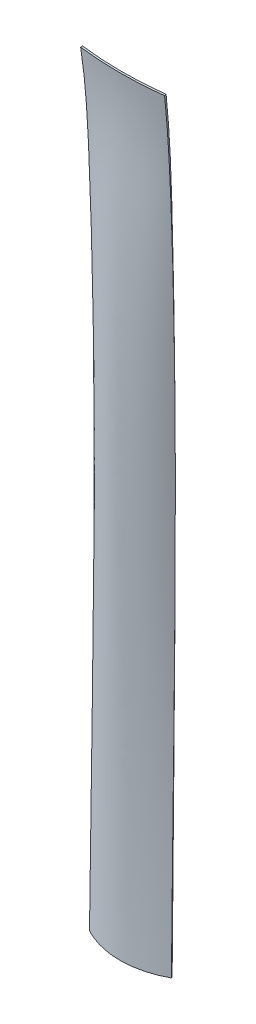
ISO-10303-21;
HEADER;
FILE_DESCRIPTION(('STEP AP214'),'2;1');
FILE_NAME('part.step','',(''),(''),'','','');
FILE_SCHEMA(('AUTOMOTIVE_DESIGN { 1 0 10303 214 1 1 1 1 }'));
ENDSEC;
DATA;
#1=APPLICATION_CONTEXT('core data for automotive mechanical design processes');
#2=APPLICATION_PROTOCOL_DEFINITION('international standard','automotive_design',2000,#1);
#3=PRODUCT_CONTEXT('',#1,'mechanical');
#4=PRODUCT('Part','Part','',(#3));
#5=PRODUCT_RELATED_PRODUCT_CATEGORY('part','',(#4));
#6=PRODUCT_DEFINITION_FORMATION('','',#4);
#7=PRODUCT_DEFINITION_CONTEXT('part definition',#1,'design');
#8=PRODUCT_DEFINITION('design','',#6,#7);
#9=PRODUCT_DEFINITION_SHAPE('','',#8);
#10=(LENGTH_UNIT() NAMED_UNIT(*) SI_UNIT(.MILLI.,.METRE.));
#11=(NAMED_UNIT(*) PLANE_ANGLE_UNIT() SI_UNIT($,.RADIAN.));
#12=(NAMED_UNIT(*) SI_UNIT($,.STERADIAN.) SOLID_ANGLE_UNIT());
#13=UNCERTAINTY_MEASURE_WITH_UNIT(LENGTH_MEASURE(1.E-05),#10,'distance_accuracy_value','');
#14=(GEOMETRIC_REPRESENTATION_CONTEXT(3) GLOBAL_UNCERTAINTY_ASSIGNED_CONTEXT((#13)) GLOBAL_UNIT_ASSIGNED_CONTEXT((#10,
#11,#12)) REPRESENTATION_CONTEXT('',''));
#15=CARTESIAN_POINT('',(0.,0.,0.));
#16=DIRECTION('',(0.,0.,1.));
#17=DIRECTION('',(1.,0.,0.));
#18=AXIS2_PLACEMENT_3D('',#15,#16,#17);
#19=CARTESIAN_POINT('',(9.50062272301137,175.,18.4603676133465));
#20=CARTESIAN_POINT('',(3.19127951394661,175.,19.2465429783567));
#21=CARTESIAN_POINT('',(-3.19127951394665,175.,19.2465429783567));
#22=CARTESIAN_POINT('',(-9.50062272301141,175.,18.4603676133465));
#23=CARTESIAN_POINT('',(9.54965754031191,174.947694814354,18.8538898544547));
#24=CARTESIAN_POINT('',(3.20777013235998,174.948930577557,19.6442846396067));
#25=CARTESIAN_POINT('',(-3.20777013236002,174.948930577557,19.6442846396067));
#26=CARTESIAN_POINT('',(-9.54965754031195,174.947694814354,18.8538898544547));
#27=B_SPLINE_SURFACE_WITH_KNOTS('',1,3,((#19,#20,#21,#22),(#23,#24,#25,#26)),.UNSPECIFIED.,.F.,
.F.,.F.,(2,2),(4,4),(0.,1.),(0.,1.),.UNSPECIFIED.);
#28=CARTESIAN_POINT('',(-9.54965754031195,174.947694814354,18.8538898544547));
#29=CARTESIAN_POINT('',(-9.50062272301141,175.,18.4603676133465));
#30=B_SPLINE_CURVE_WITH_KNOTS('',1,(#28,#29),.UNSPECIFIED.,.F.,.F.,(2,2),(0.,1.),.UNSPECIFIED.);
#31=CARTESIAN_POINT('',(-9.54965753794148,174.947694727238,18.8538898431711));
#32=VERTEX_POINT('',#31);
#33=CARTESIAN_POINT('',(-9.50062272301141,175.,18.4603676133465));
#34=VERTEX_POINT('',#33);
#35=EDGE_CURVE('E11',#32,#34,#30,.T.);
#36=CARTESIAN_POINT('',(-9.54965754031195,174.947694814354,18.8538898544547));
#37=CARTESIAN_POINT('',(-3.20777013236002,174.948930577557,19.6442846396067));
#38=CARTESIAN_POINT('',(3.20777013235998,174.948930577557,19.6442846396067));
#39=CARTESIAN_POINT('',(9.54965754031191,174.947694814354,18.8538898544547));
#40=B_SPLINE_CURVE_WITH_KNOTS('',3,(#36,#37,#38,#39),.UNSPECIFIED.,.F.,.F.,(4,4),(0.,1.),.UNSPECIFIED.);
#41=CARTESIAN_POINT('',(9.54965753079908,174.947694814356,18.8538898556403));
#42=VERTEX_POINT('',#41);
#43=EDGE_CURVE('E101',#32,#42,#40,.T.);
#44=CARTESIAN_POINT('',(9.54965754031191,174.947694814354,18.8538898544547));
#45=CARTESIAN_POINT('',(9.50062272301137,175.,18.4603676133465));
#46=B_SPLINE_CURVE_WITH_KNOTS('',1,(#44,#45),.UNSPECIFIED.,.F.,.F.,(2,2),(0.,1.),.UNSPECIFIED.);
#47=CARTESIAN_POINT('',(9.50062272301137,175.,18.4603676133465));
#48=VERTEX_POINT('',#47);
#49=EDGE_CURVE('E49',#42,#48,#46,.T.);
#50=CARTESIAN_POINT('',(-9.50062272301141,175.,18.4603676133465));
#51=CARTESIAN_POINT('',(-3.19127951394665,175.,19.2465429783567));
#52=CARTESIAN_POINT('',(3.19127951394661,175.,19.2465429783567));
#53=CARTESIAN_POINT('',(9.50062272301137,175.,18.4603676133465));
#54=B_SPLINE_CURVE_WITH_KNOTS('',3,(#50,#51,#52,#53),.UNSPECIFIED.,.F.,.F.,(4,4),(0.,1.),.UNSPECIFIED.);
#55=EDGE_CURVE('E236',#34,#48,#54,.T.);
#56=ORIENTED_EDGE('',*,*,#35,.F.);
#57=ORIENTED_EDGE('',*,*,#43,.T.);
#58=ORIENTED_EDGE('',*,*,#49,.T.);
#59=ORIENTED_EDGE('',*,*,#55,.F.);
#60=EDGE_LOOP('',(#56,#57,#58,#59));
#61=FACE_BOUND('',#60,.T.);
#62=ADVANCED_FACE('F35',(#61),#27,.F.);
#63=CARTESIAN_POINT('',(9.13305651041006,0.,16.7179478040116));
#64=CARTESIAN_POINT('',(9.10242362118428,14.5874827791793,16.5727349112747));
#65=CARTESIAN_POINT('',(9.05842448259301,29.17759846797,16.3641603251273));
#66=CARTESIAN_POINT('',(8.98273007342552,58.3577161391967,16.0053367078641));
#67=CARTESIAN_POINT('',(8.9510348028493,72.9477181216326,15.8550876767483));
#68=CARTESIAN_POINT('',(8.94199707305575,94.8286011713372,15.812245002738));
#69=CARTESIAN_POINT('',(8.94540202580303,102.12154220058,15.8283859235118));
#70=CARTESIAN_POINT('',(8.9699265358311,116.705378510387,15.944642507012));
#71=CARTESIAN_POINT('',(8.9910460931119,123.99627379095,16.0447581697385));
#72=CARTESIAN_POINT('',(9.03967104181566,134.930578069761,16.2752610585914));
#73=CARTESIAN_POINT('',(9.05870362684734,138.575006389026,16.3654835873362));
#74=CARTESIAN_POINT('',(9.09194636501331,144.0410761661,16.5230682714316));
#75=CARTESIAN_POINT('',(9.10380958783838,145.86300397482,16.5793049812931));
#76=CARTESIAN_POINT('',(9.12917689659846,149.506658184768,16.69955678839));
#77=CARTESIAN_POINT('',(9.14249365435798,151.328390500802,16.7626838705886));
#78=CARTESIAN_POINT('',(9.18690823182216,156.793209944169,16.973227813268));
#79=CARTESIAN_POINT('',(9.22302104918561,160.435902178857,17.1444178905596));
#80=CARTESIAN_POINT('',(9.33016005976901,167.719488686941,17.6523022607575));
#81=CARTESIAN_POINT('',(9.40118625298895,171.360382960338,17.9889965536639));
#82=CARTESIAN_POINT('',(9.50062272301137,175.,18.4603676133465));
#83=CARTESIAN_POINT('',(9.32481762493465,0.00389692311497571,17.0689641696508));
#84=CARTESIAN_POINT('',(9.29470936483299,14.5925291041365,16.9234519102562));
#85=CARTESIAN_POINT('',(9.27813646614287,29.1827862734098,16.6997657405732));
#86=CARTESIAN_POINT('',(9.25081294940914,58.36159007335,16.3037455350724));
#87=CARTESIAN_POINT('',(9.23915794321485,72.9502275496611,16.1327494244119));
#88=CARTESIAN_POINT('',(9.2409175524814,94.8283217894422,16.0780941907476));
#89=CARTESIAN_POINT('',(9.24510505604379,102.120198079987,16.0933487573779));
#90=CARTESIAN_POINT('',(9.26258927139339,116.701440507119,16.2173365327432));
#91=CARTESIAN_POINT('',(9.27625601396391,123.990805962327,16.3261341762202));
#92=CARTESIAN_POINT('',(9.2988871381627,134.922134935665,16.5800109431897));
#93=CARTESIAN_POINT('',(9.30667475205672,138.56545392985,16.6797860978806));
#94=CARTESIAN_POINT('',(9.31655344974621,144.029661249756,16.8539959165593));
#95=CARTESIAN_POINT('',(9.31953077198406,145.850935571256,16.9161461226555));
#96=CARTESIAN_POINT('',(9.32437592081196,149.493228072448,17.0486415964199));
#97=CARTESIAN_POINT('',(9.32590548183998,151.314325980766,17.1181666622595));
#98=CARTESIAN_POINT('',(9.33148721587132,156.775396087183,17.346861967627));
#99=CARTESIAN_POINT('',(9.33720221160047,160.413659010847,17.5279563352276));
#100=CARTESIAN_POINT('',(9.396607144769,167.684876201052,18.0460288100623));
#101=CARTESIAN_POINT('',(9.45088745704535,171.317849401046,18.3837345597982));
#102=CARTESIAN_POINT('',(9.54965754031191,174.947694814354,18.8538898544547));
#103=B_SPLINE_SURFACE_WITH_KNOTS('',1,3,((#63,#64,#65,#66,#67,#68,#69,#70,#71,#72,#73,#74,#75,
#76,#77,#78,#79,#80,#81,#82),(#83,#84,#85,#86,#87,#88,#89,#90,#91,#92,#93,#94,#95,#96,#97,#98,
#99,#100,#101,#102)),.UNSPECIFIED.,.F.,.F.,.F.,(2,2),(4,2,2,2,2,2,2,2,2,4),(0.,1.),(0.,0.25,0.5,
0.625,0.75,0.8125,0.84375,0.875,0.9375,1.),.UNSPECIFIED.);
#104=CARTESIAN_POINT('',(9.54965754031191,174.947694814354,18.8538898544547));
#105=CARTESIAN_POINT('',(9.45088745704535,171.317849401046,18.3837345597982));
#106=CARTESIAN_POINT('',(9.396607144769,167.684876201052,18.0460288100623));
#107=CARTESIAN_POINT('',(9.33720221160047,160.413659010847,17.5279563352276));
#108=CARTESIAN_POINT('',(9.33148721587132,156.775396087183,17.346861967627));
#109=CARTESIAN_POINT('',(9.32590548183998,151.314325980766,17.1181666622595));
#110=CARTESIAN_POINT('',(9.32437592081196,149.493228072448,17.0486415964199));
#111=CARTESIAN_POINT('',(9.31953077198406,145.850935571256,16.9161461226555));
#112=CARTESIAN_POINT('',(9.31655344974621,144.029661249756,16.8539959165593));
#113=CARTESIAN_POINT('',(9.30667475205672,138.56545392985,16.6797860978806));
#114=CARTESIAN_POINT('',(9.2988871381627,134.922134935665,16.5800109431897));
#115=CARTESIAN_POINT('',(9.27625601396391,123.990805962327,16.3261341762202));
#116=CARTESIAN_POINT('',(9.26258927139339,116.701440507119,16.2173365327432));
#117=CARTESIAN_POINT('',(9.24510505604379,102.120198079987,16.0933487573779));
#118=CARTESIAN_POINT('',(9.2409175524814,94.8283217894422,16.0780941907476));
#119=CARTESIAN_POINT('',(9.23915794321485,72.9502275496611,16.1327494244119));
#120=CARTESIAN_POINT('',(9.25081294940914,58.36159007335,16.3037455350724));
#121=CARTESIAN_POINT('',(9.27813646614287,29.1827862734098,16.6997657405732));
#122=CARTESIAN_POINT('',(9.29470936483299,14.5925291041365,16.9234519102562));
#123=CARTESIAN_POINT('',(9.32481762493465,0.00389692311497571,17.0689641696508));
#124=B_SPLINE_CURVE_WITH_KNOTS('',3,(#104,#105,#106,#107,#108,#109,#110,#111,#112,#113,#114,
#115,#116,#117,#118,#119,#120,#121,#122,#123),.UNSPECIFIED.,.F.,.F.,(4,2,2,2,2,2,2,2,2,4),(0.,
0.0625,0.125,0.15625,0.1875,0.25,0.375,0.5,0.75,1.),.UNSPECIFIED.);
#125=CARTESIAN_POINT('',(9.324817624754,0.00389701064665973,17.0689641687777));
#126=VERTEX_POINT('',#125);
#127=EDGE_CURVE('E269',#42,#126,#124,.T.);
#128=CARTESIAN_POINT('',(9.32481762493465,0.00389692311497571,17.0689641696508));
#129=CARTESIAN_POINT('',(9.13305651041006,0.,16.7179478040116));
#130=B_SPLINE_CURVE_WITH_KNOTS('',1,(#128,#129),.UNSPECIFIED.,.F.,.F.,(2,2),(0.,1.),.UNSPECIFIED.);
#131=CARTESIAN_POINT('',(9.13305651041006,0.,16.7179478040116));
#132=VERTEX_POINT('',#131);
#133=EDGE_CURVE('E91',#126,#132,#130,.T.);
#134=CARTESIAN_POINT('',(9.50062272301137,175.,18.4603676133465));
#135=CARTESIAN_POINT('',(9.27309260754276,166.67184348852,17.3817783229789));
#136=CARTESIAN_POINT('',(8.72224151503973,108.391209879575,14.7705104135093));
#137=CARTESIAN_POINT('',(9.02804846580856,50.0051768218529,16.2201651167556));
#138=CARTESIAN_POINT('',(9.13305651041006,0.,16.7179478040116));
#139=B_SPLINE_CURVE_WITH_KNOTS('',3,(#134,#135,#136,#137,#138),.UNSPECIFIED.,.F.,.F.,(4,1,4),
(0.,0.143012239006285,1.),.UNSPECIFIED.);
#140=EDGE_CURVE('E109',#48,#132,#139,.T.);
#141=ORIENTED_EDGE('',*,*,#49,.F.);
#142=ORIENTED_EDGE('',*,*,#127,.T.);
#143=ORIENTED_EDGE('',*,*,#133,.T.);
#144=ORIENTED_EDGE('',*,*,#140,.F.);
#145=EDGE_LOOP('',(#141,#142,#143,#144));
#146=FACE_BOUND('',#145,.T.);
#147=ADVANCED_FACE('F132',(#146),#103,.F.);
#148=CARTESIAN_POINT('',(9.13305651041006,0.,16.7179478040116));
#149=CARTESIAN_POINT('',(3.44193473600555,0.,19.827021799373));
#150=CARTESIAN_POINT('',(-3.44193473600556,0.,19.827021799373));
#151=CARTESIAN_POINT('',(-9.13305651041007,0.,16.7179478040116));
#152=CARTESIAN_POINT('',(9.32481762493465,0.00389692311497571,17.0689641696508));
#153=CARTESIAN_POINT('',(3.51417604446942,0.0040260235286238,20.2433306993983));
#154=CARTESIAN_POINT('',(-3.51417604446943,0.00402602352862382,20.2433306993983));
#155=CARTESIAN_POINT('',(-9.32481762493466,0.00389692311497574,17.0689641696508));
#156=B_SPLINE_SURFACE_WITH_KNOTS('',1,3,((#148,#149,#150,#151),(#152,#153,#154,#155)),
.UNSPECIFIED.,.F.,.F.,.F.,(2,2),(4,4),(0.,1.),(0.,1.),.UNSPECIFIED.);
#157=CARTESIAN_POINT('',(9.32481762493465,0.00389692311497571,17.0689641696508));
#158=CARTESIAN_POINT('',(3.51417604446942,0.0040260235286238,20.2433306993983));
#159=CARTESIAN_POINT('',(-3.51417604446943,0.00402602352862382,20.2433306993983));
#160=CARTESIAN_POINT('',(-9.32481762493466,0.00389692311497574,17.0689641696508));
#161=B_SPLINE_CURVE_WITH_KNOTS('',3,(#157,#158,#159,#160),.UNSPECIFIED.,.F.,.F.,(4,4),(0.,1.),.UNSPECIFIED.);
#162=CARTESIAN_POINT('',(-9.32481762475401,0.00389701064665977,17.0689641687777));
#163=VERTEX_POINT('',#162);
#164=EDGE_CURVE('E99',#126,#163,#161,.T.);
#165=CARTESIAN_POINT('',(-9.32481762493466,0.00389692311497574,17.0689641696508));
#166=CARTESIAN_POINT('',(-9.13305651041007,0.,16.7179478040116));
#167=B_SPLINE_CURVE_WITH_KNOTS('',1,(#165,#166),.UNSPECIFIED.,.F.,.F.,(2,2),(0.,1.),.UNSPECIFIED.);
#168=CARTESIAN_POINT('',(-9.13305651041007,0.,16.7179478040116));
#169=VERTEX_POINT('',#168);
#170=EDGE_CURVE('E79',#163,#169,#167,.T.);
#171=CARTESIAN_POINT('',(9.13305651041006,0.,16.7179478040116));
#172=CARTESIAN_POINT('',(3.44193473600555,0.,19.827021799373));
#173=CARTESIAN_POINT('',(-3.44193473600556,0.,19.827021799373));
#174=CARTESIAN_POINT('',(-9.13305651041007,0.,16.7179478040116));
#175=B_SPLINE_CURVE_WITH_KNOTS('',3,(#171,#172,#173,#174),.UNSPECIFIED.,.F.,.F.,(4,4),(0.,1.),.UNSPECIFIED.);
#176=EDGE_CURVE('E92',#132,#169,#175,.T.);
#177=ORIENTED_EDGE('',*,*,#133,.F.);
#178=ORIENTED_EDGE('',*,*,#164,.T.);
#179=ORIENTED_EDGE('',*,*,#170,.T.);
#180=ORIENTED_EDGE('',*,*,#176,.F.);
#181=EDGE_LOOP('',(#177,#178,#179,#180));
#182=FACE_BOUND('',#181,.T.);
#183=ADVANCED_FACE('F106',(#182),#156,.T.);
#184=CARTESIAN_POINT('',(-9.13305651041007,0.,16.7179478040116));
#185=CARTESIAN_POINT('',(-9.10242362118428,14.5874827791793,16.5727349112747));
#186=CARTESIAN_POINT('',(-9.05842448259301,29.17759846797,16.3641603251273));
#187=CARTESIAN_POINT('',(-8.98273007342552,58.3577161391967,16.0053367078641));
#188=CARTESIAN_POINT('',(-8.95103480284929,72.9477181216326,15.8550876767483));
#189=CARTESIAN_POINT('',(-8.94199707305574,94.8286011713372,15.812245002738));
#190=CARTESIAN_POINT('',(-8.94540202580302,102.12154220058,15.8283859235117));
#191=CARTESIAN_POINT('',(-8.9699265358311,116.705378510387,15.944642507012));
#192=CARTESIAN_POINT('',(-8.99104609311189,123.99627379095,16.0447581697384));
#193=CARTESIAN_POINT('',(-9.03967104181566,134.930578069761,16.2752610585914));
#194=CARTESIAN_POINT('',(-9.05870362684734,138.575006389026,16.3654835873362));
#195=CARTESIAN_POINT('',(-9.09194636501332,144.0410761661,16.5230682714316));
#196=CARTESIAN_POINT('',(-9.10380958783838,145.86300397482,16.5793049812931));
#197=CARTESIAN_POINT('',(-9.12917689659846,149.506658184768,16.69955678839));
#198=CARTESIAN_POINT('',(-9.14249365435799,151.328390500802,16.7626838705886));
#199=CARTESIAN_POINT('',(-9.18690823182217,156.793209944169,16.973227813268));
#200=CARTESIAN_POINT('',(-9.22302104918563,160.435902178857,17.1444178905596));
#201=CARTESIAN_POINT('',(-9.33016005976903,167.719488686941,17.6523022607575));
#202=CARTESIAN_POINT('',(-9.40118625298898,171.360382960338,17.9889965536639));
#203=CARTESIAN_POINT('',(-9.50062272301141,175.,18.4603676133465));
#204=CARTESIAN_POINT('',(-9.32481762493466,0.00389692311497574,17.0689641696508));
#205=CARTESIAN_POINT('',(-9.294709364833,14.5925291041365,16.9234519102562));
#206=CARTESIAN_POINT('',(-9.27813646614287,29.1827862734098,16.6997657405732));
#207=CARTESIAN_POINT('',(-9.25081294940913,58.36159007335,16.3037455350724));
#208=CARTESIAN_POINT('',(-9.23915794321484,72.9502275496611,16.1327494244119));
#209=CARTESIAN_POINT('',(-9.2409175524814,94.8283217894422,16.0780941907476));
#210=CARTESIAN_POINT('',(-9.24510505604379,102.120198079987,16.0933487573779));
#211=CARTESIAN_POINT('',(-9.26258927139338,116.701440507119,16.2173365327432));
#212=CARTESIAN_POINT('',(-9.27625601396391,123.990805962327,16.3261341762202));
#213=CARTESIAN_POINT('',(-9.2988871381627,134.922134935665,16.5800109431897));
#214=CARTESIAN_POINT('',(-9.30667475205673,138.56545392985,16.6797860978806));
#215=CARTESIAN_POINT('',(-9.31655344974622,144.029661249756,16.8539959165593));
#216=CARTESIAN_POINT('',(-9.31953077198406,145.850935571256,16.9161461226555));
#217=CARTESIAN_POINT('',(-9.32437592081197,149.493228072448,17.0486415964199));
#218=CARTESIAN_POINT('',(-9.32590548183999,151.314325980766,17.1181666622595));
#219=CARTESIAN_POINT('',(-9.33148721587133,156.775396087183,17.3468619676269));
#220=CARTESIAN_POINT('',(-9.33720221160049,160.413659010847,17.5279563352276));
#221=CARTESIAN_POINT('',(-9.39660714476902,167.684876201052,18.0460288100623));
#222=CARTESIAN_POINT('',(-9.45088745704538,171.317849401046,18.3837345597982));
#223=CARTESIAN_POINT('',(-9.54965754031195,174.947694814354,18.8538898544547));
#224=B_SPLINE_SURFACE_WITH_KNOTS('',1,3,((#184,#185,#186,#187,#188,#189,#190,#191,#192,#193,
#194,#195,#196,#197,#198,#199,#200,#201,#202,#203),(#204,#205,#206,#207,#208,#209,#210,#211,
#212,#213,#214,#215,#216,#217,#218,#219,#220,#221,#222,#223)),.UNSPECIFIED.,.F.,.F.,.F.,(2,2),
(4,2,2,2,2,2,2,2,2,4),(0.,1.),(0.,0.25,0.5,0.625,0.75,0.8125,0.84375,0.875,0.9375,1.),.UNSPECIFIED.);
#225=CARTESIAN_POINT('',(-9.32481762493466,0.00389692311497574,17.0689641696508));
#226=CARTESIAN_POINT('',(-9.294709364833,14.5925291041365,16.9234519102562));
#227=CARTESIAN_POINT('',(-9.27813646614287,29.1827862734098,16.6997657405732));
#228=CARTESIAN_POINT('',(-9.25081294940913,58.36159007335,16.3037455350724));
#229=CARTESIAN_POINT('',(-9.23915794321484,72.9502275496611,16.1327494244119));
#230=CARTESIAN_POINT('',(-9.2409175524814,94.8283217894422,16.0780941907476));
#231=CARTESIAN_POINT('',(-9.24510505604379,102.120198079987,16.0933487573779));
#232=CARTESIAN_POINT('',(-9.26258927139338,116.701440507119,16.2173365327432));
#233=CARTESIAN_POINT('',(-9.27625601396391,123.990805962327,16.3261341762202));
#234=CARTESIAN_POINT('',(-9.2988871381627,134.922134935665,16.5800109431897));
#235=CARTESIAN_POINT('',(-9.30667475205673,138.56545392985,16.6797860978806));
#236=CARTESIAN_POINT('',(-9.31655344974622,144.029661249756,16.8539959165593));
#237=CARTESIAN_POINT('',(-9.31953077198406,145.850935571256,16.9161461226555));
#238=CARTESIAN_POINT('',(-9.32437592081197,149.493228072448,17.0486415964199));
#239=CARTESIAN_POINT('',(-9.32590548183999,151.314325980766,17.1181666622595));
#240=CARTESIAN_POINT('',(-9.33148721587133,156.775396087183,17.3468619676269));
#241=CARTESIAN_POINT('',(-9.33720221160049,160.413659010847,17.5279563352276));
#242=CARTESIAN_POINT('',(-9.39660714476902,167.684876201052,18.0460288100623));
#243=CARTESIAN_POINT('',(-9.45088745704538,171.317849401046,18.3837345597982));
#244=CARTESIAN_POINT('',(-9.54965754031195,174.947694814354,18.8538898544547));
#245=B_SPLINE_CURVE_WITH_KNOTS('',3,(#225,#226,#227,#228,#229,#230,#231,#232,#233,#234,#235,
#236,#237,#238,#239,#240,#241,#242,#243,#244),.UNSPECIFIED.,.F.,.F.,(4,2,2,2,2,2,2,2,2,4),(0.,
0.25,0.5,0.625,0.75,0.8125,0.84375,0.875,0.9375,1.),.UNSPECIFIED.);
#246=EDGE_CURVE('E81',#163,#32,#245,.T.);
#247=CARTESIAN_POINT('',(-9.13305651041007,0.,16.7179478040116));
#248=CARTESIAN_POINT('',(-9.02804846580856,50.0051768218529,16.2201651167556));
#249=CARTESIAN_POINT('',(-8.7222415150397,108.391209879575,14.7705104135093));
#250=CARTESIAN_POINT('',(-9.27309260754278,166.67184348852,17.3817783229789));
#251=CARTESIAN_POINT('',(-9.50062272301141,175.,18.4603676133465));
#252=B_SPLINE_CURVE_WITH_KNOTS('',3,(#247,#248,#249,#250,#251),.UNSPECIFIED.,.F.,.F.,(4,1,4),
(0.,0.856987760993715,1.),.UNSPECIFIED.);
#253=EDGE_CURVE('E84',#169,#34,#252,.T.);
#254=ORIENTED_EDGE('',*,*,#246,.T.);
#255=ORIENTED_EDGE('',*,*,#35,.T.);
#256=ORIENTED_EDGE('',*,*,#253,.F.);
#257=ORIENTED_EDGE('',*,*,#170,.F.);
#258=EDGE_LOOP('',(#254,#255,#256,#257));
#259=FACE_BOUND('',#258,.T.);
#260=ADVANCED_FACE('F37',(#259),#224,.T.);
#261=CARTESIAN_POINT('',(9.13305651041006,0.,16.7179478040116));
#262=CARTESIAN_POINT('',(9.02804846580856,50.0051768218529,16.2201651167556));
#263=CARTESIAN_POINT('',(8.72224151503973,108.391209879575,14.7705104135093));
#264=CARTESIAN_POINT('',(9.27309260754276,166.67184348852,17.3817783229789));
#265=CARTESIAN_POINT('',(9.50062272301137,175.,18.4603676133465));
#266=CARTESIAN_POINT('',(3.44193473600555,0.,19.827021799373));
#267=CARTESIAN_POINT('',(3.40693205447172,50.0051768218529,19.329239112117));
#268=CARTESIAN_POINT('',(4.42311180098343,108.391209879575,24.8394631929256));
#269=CARTESIAN_POINT('',(3.11543614212375,166.67184348852,18.1679536879891));
#270=CARTESIAN_POINT('',(3.19127951394661,175.,19.2465429783567));
#271=CARTESIAN_POINT('',(-3.44193473600556,0.,19.827021799373));
#272=CARTESIAN_POINT('',(-3.40693205447172,50.0051768218529,19.329239112117));
#273=CARTESIAN_POINT('',(-4.42311180098341,108.391209879575,24.8394631929256));
#274=CARTESIAN_POINT('',(-3.11543614212377,166.67184348852,18.1679536879891));
#275=CARTESIAN_POINT('',(-3.19127951394665,175.,19.2465429783567));
#276=CARTESIAN_POINT('',(-9.13305651041007,0.,16.7179478040116));
#277=CARTESIAN_POINT('',(-9.02804846580856,50.0051768218529,16.2201651167556));
#278=CARTESIAN_POINT('',(-8.7222415150397,108.391209879575,14.7705104135093));
#279=CARTESIAN_POINT('',(-9.27309260754278,166.67184348852,17.3817783229789));
#280=CARTESIAN_POINT('',(-9.50062272301141,175.,18.4603676133465));
#281=B_SPLINE_SURFACE_WITH_KNOTS('',3,3,((#261,#262,#263,#264,#265),(#266,#267,#268,#269,#270),
(#271,#272,#273,#274,#275),(#276,#277,#278,#279,#280)),.UNSPECIFIED.,.F.,.F.,.F.,(4,4),(4,1,4),
(0.,1.),(0.,0.856987760993715,1.),.UNSPECIFIED.);
#282=ORIENTED_EDGE('',*,*,#176,.T.);
#283=ORIENTED_EDGE('',*,*,#253,.T.);
#284=ORIENTED_EDGE('',*,*,#55,.T.);
#285=ORIENTED_EDGE('',*,*,#140,.T.);
#286=EDGE_LOOP('',(#282,#283,#284,#285));
#287=FACE_BOUND('',#286,.T.);
#288=ADVANCED_FACE('F195',(#287),#281,.T.);
#289=CARTESIAN_POINT('',(9.13305651041006,0.,16.7179478040116));
#290=CARTESIAN_POINT('',(9.02804846580856,50.0051768218529,16.2201651167556));
#291=CARTESIAN_POINT('',(8.72224151503973,108.391209879575,14.7705104135093));
#292=CARTESIAN_POINT('',(9.27309260754276,166.67184348852,17.3817783229789));
#293=CARTESIAN_POINT('',(9.50062272301137,175.,18.4603676133465));
#294=CARTESIAN_POINT('',(3.44193473600555,0.,19.827021799373));
#295=CARTESIAN_POINT('',(3.40693205447172,50.0051768218529,19.329239112117));
#296=CARTESIAN_POINT('',(4.42311180098343,108.391209879575,24.8394631929256));
#297=CARTESIAN_POINT('',(3.11543614212375,166.67184348852,18.1679536879891));
#298=CARTESIAN_POINT('',(3.19127951394661,175.,19.2465429783567));
#299=CARTESIAN_POINT('',(-3.44193473600556,0.,19.827021799373));
#300=CARTESIAN_POINT('',(-3.40693205447172,50.0051768218529,19.329239112117));
#301=CARTESIAN_POINT('',(-4.42311180098341,108.391209879575,24.8394631929256));
#302=CARTESIAN_POINT('',(-3.11543614212377,166.67184348852,18.1679536879891));
#303=CARTESIAN_POINT('',(-3.19127951394665,175.,19.2465429783567));
#304=CARTESIAN_POINT('',(-9.13305651041007,0.,16.7179478040116));
#305=CARTESIAN_POINT('',(-9.02804846580856,50.0051768218529,16.2201651167556));
#306=CARTESIAN_POINT('',(-8.7222415150397,108.391209879575,14.7705104135093));
#307=CARTESIAN_POINT('',(-9.27309260754278,166.67184348852,17.3817783229789));
#308=CARTESIAN_POINT('',(-9.50062272301141,175.,18.4603676133465));
#309=B_SPLINE_SURFACE_WITH_KNOTS('',3,3,((#289,#290,#291,#292,#293),(#294,#295,#296,#297,#298),
(#299,#300,#301,#302,#303),(#304,#305,#306,#307,#308)),.UNSPECIFIED.,.F.,.F.,.F.,(4,4),(4,1,4),
(0.,1.),(0.,0.856987760993715,1.),.UNSPECIFIED.);
#310=OFFSET_SURFACE('',#309,-0.4,.F.);
#311=ORIENTED_EDGE('',*,*,#164,.F.);
#312=ORIENTED_EDGE('',*,*,#127,.F.);
#313=ORIENTED_EDGE('',*,*,#43,.F.);
#314=ORIENTED_EDGE('',*,*,#246,.F.);
#315=EDGE_LOOP('',(#311,#312,#313,#314));
#316=FACE_BOUND('',#315,.T.);
#317=ADVANCED_FACE('F97',(#316),#310,.F.);
#318=CLOSED_SHELL('',(#62,#147,#183,#260,#288,#317));
#319=MANIFOLD_SOLID_BREP('B2',#318);
#320=ADVANCED_BREP_SHAPE_REPRESENTATION('',(#18,#319),#14);
#321=SHAPE_DEFINITION_REPRESENTATION(#9,#320);
ENDSEC;
END-ISO-10303-21;
